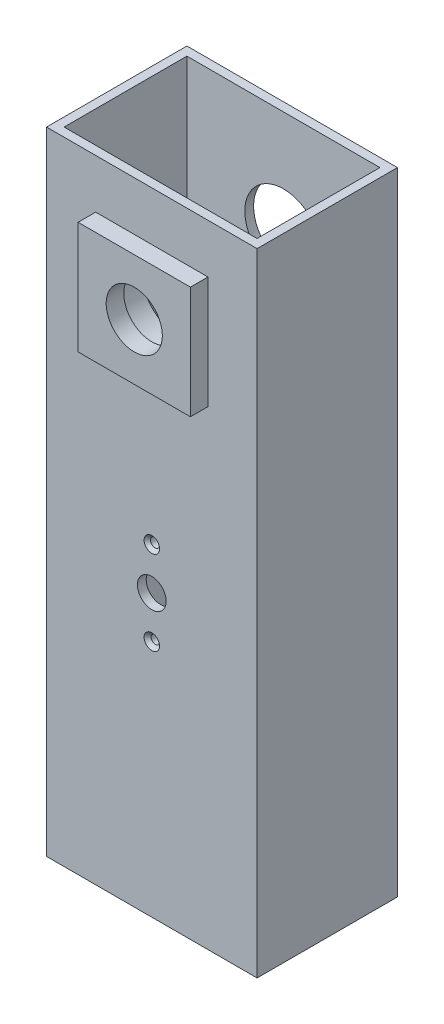
ISO-10303-21;
HEADER;
FILE_DESCRIPTION(('STEP AP214'),'2;1');
FILE_NAME('part.step','',(''),(''),'','','');
FILE_SCHEMA(('AUTOMOTIVE_DESIGN { 1 0 10303 214 1 1 1 1 }'));
ENDSEC;
DATA;
#1=APPLICATION_CONTEXT('core data for automotive mechanical design processes');
#2=APPLICATION_PROTOCOL_DEFINITION('international standard','automotive_design',2000,#1);
#3=PRODUCT_CONTEXT('',#1,'mechanical');
#4=PRODUCT('Part','Part','',(#3));
#5=PRODUCT_RELATED_PRODUCT_CATEGORY('part','',(#4));
#6=PRODUCT_DEFINITION_FORMATION('','',#4);
#7=PRODUCT_DEFINITION_CONTEXT('part definition',#1,'design');
#8=PRODUCT_DEFINITION('design','',#6,#7);
#9=PRODUCT_DEFINITION_SHAPE('','',#8);
#10=(LENGTH_UNIT() NAMED_UNIT(*) SI_UNIT(.MILLI.,.METRE.));
#11=(NAMED_UNIT(*) PLANE_ANGLE_UNIT() SI_UNIT($,.RADIAN.));
#12=(NAMED_UNIT(*) SI_UNIT($,.STERADIAN.) SOLID_ANGLE_UNIT());
#13=UNCERTAINTY_MEASURE_WITH_UNIT(LENGTH_MEASURE(1.E-05),#10,'distance_accuracy_value','');
#14=(GEOMETRIC_REPRESENTATION_CONTEXT(3) GLOBAL_UNCERTAINTY_ASSIGNED_CONTEXT((#13)) GLOBAL_UNIT_ASSIGNED_CONTEXT((#10,
#11,#12)) REPRESENTATION_CONTEXT('',''));
#15=CARTESIAN_POINT('',(0.,0.,0.));
#16=DIRECTION('',(0.,0.,1.));
#17=DIRECTION('',(1.,0.,0.));
#18=AXIS2_PLACEMENT_3D('',#15,#16,#17);
#19=CARTESIAN_POINT('',(-30.,170.,74.3766285992629));
#20=DIRECTION('',(0.,0.,-1.));
#21=DIRECTION('',(-1.,0.,0.));
#22=AXIS2_PLACEMENT_3D('',#19,#20,#21);
#23=CYLINDRICAL_SURFACE('',#22,11.);
#24=CARTESIAN_POINT('',(-30.,170.,32.));
#25=DIRECTION('',(0.,0.,-1.));
#26=DIRECTION('',(-1.,0.,0.));
#27=AXIS2_PLACEMENT_3D('',#24,#25,#26);
#28=CIRCLE('',#27,11.);
#29=CARTESIAN_POINT('',(-41.,170.,32.));
#30=VERTEX_POINT('',#29);
#31=EDGE_CURVE('E168',#30,#30,#28,.T.);
#32=ORIENTED_EDGE('',*,*,#31,.T.);
#33=EDGE_LOOP('',(#32));
#34=FACE_BOUND('',#33,.T.);
#35=CARTESIAN_POINT('',(-30.,170.,40.));
#36=DIRECTION('',(0.,0.,1.));
#37=DIRECTION('',(1.,0.,0.));
#38=AXIS2_PLACEMENT_3D('',#35,#36,#37);
#39=CIRCLE('',#38,11.);
#40=CARTESIAN_POINT('',(-19.,170.,40.));
#41=VERTEX_POINT('',#40);
#42=EDGE_CURVE('E11',#41,#41,#39,.F.);
#43=ORIENTED_EDGE('',*,*,#42,.F.);
#44=EDGE_LOOP('',(#43));
#45=FACE_BOUND('',#44,.T.);
#46=ADVANCED_FACE('F33',(#34,#45),#23,.F.);
#47=CARTESIAN_POINT('',(0.,200.,40.));
#48=DIRECTION('',(0.,0.,-1.));
#49=DIRECTION('',(-1.,0.,0.));
#50=AXIS2_PLACEMENT_3D('',#47,#48,#49);
#51=PLANE('',#50);
#52=DIRECTION('',(-1.,0.,0.));
#53=VECTOR('',#52,1.);
#54=CARTESIAN_POINT('',(0.,20.,40.));
#55=LINE('',#54,#53);
#56=CARTESIAN_POINT('',(0.,20.,40.));
#57=VERTEX_POINT('',#56);
#58=CARTESIAN_POINT('',(-60.,20.,40.));
#59=VERTEX_POINT('',#58);
#60=EDGE_CURVE('E227',#57,#59,#55,.T.);
#61=ORIENTED_EDGE('',*,*,#60,.F.);
#62=DIRECTION('',(0.,-1.,0.));
#63=VECTOR('',#62,1.);
#64=CARTESIAN_POINT('',(0.,200.,40.));
#65=LINE('',#64,#63);
#66=CARTESIAN_POINT('',(0.,200.,40.));
#67=VERTEX_POINT('',#66);
#68=EDGE_CURVE('E285',#67,#57,#65,.T.);
#69=ORIENTED_EDGE('',*,*,#68,.F.);
#70=DIRECTION('',(1.,0.,0.));
#71=VECTOR('',#70,1.);
#72=CARTESIAN_POINT('',(0.,200.,40.));
#73=LINE('',#72,#71);
#74=CARTESIAN_POINT('',(-60.,200.,40.));
#75=VERTEX_POINT('',#74);
#76=EDGE_CURVE('E283',#75,#67,#73,.T.);
#77=ORIENTED_EDGE('',*,*,#76,.F.);
#78=DIRECTION('',(0.,-1.,0.));
#79=VECTOR('',#78,1.);
#80=CARTESIAN_POINT('',(-60.,200.,40.));
#81=LINE('',#80,#79);
#82=EDGE_CURVE('E288',#75,#59,#81,.T.);
#83=ORIENTED_EDGE('',*,*,#82,.T.);
#84=EDGE_LOOP('',(#61,#69,#77,#83));
#85=FACE_BOUND('',#84,.T.);
#86=CARTESIAN_POINT('',(-30.,100.,40.));
#87=DIRECTION('',(0.,0.,1.));
#88=DIRECTION('',(1.,0.,0.));
#89=AXIS2_PLACEMENT_3D('',#86,#87,#88);
#90=CIRCLE('',#89,4.1);
#91=CARTESIAN_POINT('',(-25.9,100.,40.));
#92=VERTEX_POINT('',#91);
#93=EDGE_CURVE('E201',#92,#92,#90,.T.);
#94=ORIENTED_EDGE('',*,*,#93,.F.);
#95=EDGE_LOOP('',(#94));
#96=FACE_BOUND('',#95,.T.);
#97=CARTESIAN_POINT('',(-30.,88.,40.));
#98=DIRECTION('',(0.,0.,1.));
#99=DIRECTION('',(1.,0.,0.));
#100=AXIS2_PLACEMENT_3D('',#97,#98,#99);
#101=CIRCLE('',#100,2.2);
#102=CARTESIAN_POINT('',(-27.8,88.,40.));
#103=VERTEX_POINT('',#102);
#104=EDGE_CURVE('E194',#103,#103,#101,.T.);
#105=ORIENTED_EDGE('',*,*,#104,.F.);
#106=EDGE_LOOP('',(#105));
#107=FACE_BOUND('',#106,.T.);
#108=CARTESIAN_POINT('',(-30.,112.,40.));
#109=DIRECTION('',(0.,0.,1.));
#110=DIRECTION('',(1.,0.,0.));
#111=AXIS2_PLACEMENT_3D('',#108,#109,#110);
#112=CIRCLE('',#111,2.2);
#113=CARTESIAN_POINT('',(-27.8,112.,40.));
#114=VERTEX_POINT('',#113);
#115=EDGE_CURVE('E188',#114,#114,#112,.T.);
#116=ORIENTED_EDGE('',*,*,#115,.F.);
#117=EDGE_LOOP('',(#116));
#118=FACE_BOUND('',#117,.T.);
#119=DIRECTION('',(0.,-1.,0.));
#120=VECTOR('',#119,1.);
#121=CARTESIAN_POINT('',(-46.,154.,40.));
#122=LINE('',#121,#120);
#123=CARTESIAN_POINT('',(-46.,186.,40.));
#124=VERTEX_POINT('',#123);
#125=CARTESIAN_POINT('',(-46.,154.,40.));
#126=VERTEX_POINT('',#125);
#127=EDGE_CURVE('E167',#124,#126,#122,.T.);
#128=ORIENTED_EDGE('',*,*,#127,.F.);
#129=DIRECTION('',(-1.,0.,0.));
#130=VECTOR('',#129,1.);
#131=CARTESIAN_POINT('',(-14.,186.,40.));
#132=LINE('',#131,#130);
#133=CARTESIAN_POINT('',(-14.,186.,40.));
#134=VERTEX_POINT('',#133);
#135=EDGE_CURVE('E164',#134,#124,#132,.T.);
#136=ORIENTED_EDGE('',*,*,#135,.F.);
#137=DIRECTION('',(0.,1.,0.));
#138=VECTOR('',#137,1.);
#139=CARTESIAN_POINT('',(-14.,154.,40.));
#140=LINE('',#139,#138);
#141=CARTESIAN_POINT('',(-14.,154.,40.));
#142=VERTEX_POINT('',#141);
#143=EDGE_CURVE('E53',#142,#134,#140,.T.);
#144=ORIENTED_EDGE('',*,*,#143,.F.);
#145=DIRECTION('',(1.,0.,0.));
#146=VECTOR('',#145,1.);
#147=CARTESIAN_POINT('',(-14.,154.,40.));
#148=LINE('',#147,#146);
#149=EDGE_CURVE('E48',#126,#142,#148,.T.);
#150=ORIENTED_EDGE('',*,*,#149,.F.);
#151=EDGE_LOOP('',(#128,#136,#144,#150));
#152=FACE_BOUND('',#151,.T.);
#153=ADVANCED_FACE('F313',(#85,#96,#107,#118,#152),#51,.F.);
#154=CARTESIAN_POINT('',(-2.5,200.,37.5));
#155=DIRECTION('',(0.,0.,-1.));
#156=DIRECTION('',(-1.,0.,0.));
#157=AXIS2_PLACEMENT_3D('',#154,#155,#156);
#158=PLANE('',#157);
#159=CARTESIAN_POINT('',(-30.,88.,37.5));
#160=DIRECTION('',(0.,0.,-1.));
#161=DIRECTION('',(-1.,0.,0.));
#162=AXIS2_PLACEMENT_3D('',#159,#160,#161);
#163=CIRCLE('',#162,1.19999999999999);
#164=CARTESIAN_POINT('',(-31.2,88.,37.5));
#165=VERTEX_POINT('',#164);
#166=EDGE_CURVE('E200',#165,#165,#163,.T.);
#167=ORIENTED_EDGE('',*,*,#166,.F.);
#168=EDGE_LOOP('',(#167));
#169=FACE_BOUND('',#168,.T.);
#170=CARTESIAN_POINT('',(-30.,112.,37.5));
#171=DIRECTION('',(0.,0.,-1.));
#172=DIRECTION('',(-1.,0.,0.));
#173=AXIS2_PLACEMENT_3D('',#170,#171,#172);
#174=CIRCLE('',#173,1.28985660847614);
#175=CARTESIAN_POINT('',(-31.2898566084761,112.,37.5));
#176=VERTEX_POINT('',#175);
#177=EDGE_CURVE('E205',#176,#176,#174,.T.);
#178=ORIENTED_EDGE('',*,*,#177,.F.);
#179=EDGE_LOOP('',(#178));
#180=FACE_BOUND('',#179,.T.);
#181=CARTESIAN_POINT('',(-30.,100.,37.5));
#182=DIRECTION('',(0.,0.,-1.));
#183=DIRECTION('',(-1.,0.,0.));
#184=AXIS2_PLACEMENT_3D('',#181,#182,#183);
#185=CIRCLE('',#184,4.1);
#186=CARTESIAN_POINT('',(-34.1,100.,37.5));
#187=VERTEX_POINT('',#186);
#188=EDGE_CURVE('E204',#187,#187,#185,.T.);
#189=ORIENTED_EDGE('',*,*,#188,.F.);
#190=EDGE_LOOP('',(#189));
#191=FACE_BOUND('',#190,.T.);
#192=DIRECTION('',(1.,0.,0.));
#193=VECTOR('',#192,1.);
#194=CARTESIAN_POINT('',(-10.,190.,37.5));
#195=LINE('',#194,#193);
#196=CARTESIAN_POINT('',(-50.,190.,37.5));
#197=VERTEX_POINT('',#196);
#198=CARTESIAN_POINT('',(-10.,190.,37.5));
#199=VERTEX_POINT('',#198);
#200=EDGE_CURVE('E232',#197,#199,#195,.T.);
#201=ORIENTED_EDGE('',*,*,#200,.F.);
#202=DIRECTION('',(0.,1.,0.));
#203=VECTOR('',#202,1.);
#204=CARTESIAN_POINT('',(-50.,150.,37.5));
#205=LINE('',#204,#203);
#206=CARTESIAN_POINT('',(-50.,150.,37.5));
#207=VERTEX_POINT('',#206);
#208=EDGE_CURVE('E229',#207,#197,#205,.T.);
#209=ORIENTED_EDGE('',*,*,#208,.F.);
#210=DIRECTION('',(-1.,0.,0.));
#211=VECTOR('',#210,1.);
#212=CARTESIAN_POINT('',(-10.,150.,37.5));
#213=LINE('',#212,#211);
#214=CARTESIAN_POINT('',(-10.,150.,37.5));
#215=VERTEX_POINT('',#214);
#216=EDGE_CURVE('E237',#215,#207,#213,.T.);
#217=ORIENTED_EDGE('',*,*,#216,.F.);
#218=DIRECTION('',(0.,-1.,0.));
#219=VECTOR('',#218,1.);
#220=CARTESIAN_POINT('',(-10.,150.,37.5));
#221=LINE('',#220,#219);
#222=EDGE_CURVE('E234',#199,#215,#221,.T.);
#223=ORIENTED_EDGE('',*,*,#222,.F.);
#224=EDGE_LOOP('',(#201,#209,#217,#223));
#225=FACE_BOUND('',#224,.T.);
#226=DIRECTION('',(0.,-1.,0.));
#227=VECTOR('',#226,1.);
#228=CARTESIAN_POINT('',(-2.5,200.,37.5));
#229=LINE('',#228,#227);
#230=CARTESIAN_POINT('',(-2.5,200.,37.5));
#231=VERTEX_POINT('',#230);
#232=CARTESIAN_POINT('',(-2.5,20.,37.5));
#233=VERTEX_POINT('',#232);
#234=EDGE_CURVE('E264',#231,#233,#229,.T.);
#235=ORIENTED_EDGE('',*,*,#234,.T.);
#236=DIRECTION('',(-1.,0.,0.));
#237=VECTOR('',#236,1.);
#238=CARTESIAN_POINT('',(-2.5,20.,37.5));
#239=LINE('',#238,#237);
#240=CARTESIAN_POINT('',(-57.5,20.,37.5));
#241=VERTEX_POINT('',#240);
#242=EDGE_CURVE('E224',#233,#241,#239,.T.);
#243=ORIENTED_EDGE('',*,*,#242,.T.);
#244=DIRECTION('',(0.,-1.,0.));
#245=VECTOR('',#244,1.);
#246=CARTESIAN_POINT('',(-57.5,200.,37.5));
#247=LINE('',#246,#245);
#248=CARTESIAN_POINT('',(-57.5,200.,37.5));
#249=VERTEX_POINT('',#248);
#250=EDGE_CURVE('E267',#249,#241,#247,.T.);
#251=ORIENTED_EDGE('',*,*,#250,.F.);
#252=DIRECTION('',(1.,0.,0.));
#253=VECTOR('',#252,1.);
#254=CARTESIAN_POINT('',(-2.5,200.,37.5));
#255=LINE('',#254,#253);
#256=EDGE_CURVE('E262',#249,#231,#255,.T.);
#257=ORIENTED_EDGE('',*,*,#256,.T.);
#258=EDGE_LOOP('',(#235,#243,#251,#257));
#259=FACE_BOUND('',#258,.T.);
#260=ADVANCED_FACE('F310',(#169,#180,#191,#225,#259),#158,.T.);
#261=CARTESIAN_POINT('',(0.,200.,0.));
#262=DIRECTION('',(-1.,0.,0.));
#263=DIRECTION('',(0.,0.,1.));
#264=AXIS2_PLACEMENT_3D('',#261,#262,#263);
#265=PLANE('',#264);
#266=DIRECTION('',(0.,0.,-1.));
#267=VECTOR('',#266,1.);
#268=CARTESIAN_POINT('',(0.,20.,73.));
#269=LINE('',#268,#267);
#270=CARTESIAN_POINT('',(0.,20.,0.));
#271=VERTEX_POINT('',#270);
#272=EDGE_CURVE('E213',#57,#271,#269,.T.);
#273=ORIENTED_EDGE('',*,*,#272,.T.);
#274=DIRECTION('',(0.,-1.,0.));
#275=VECTOR('',#274,1.);
#276=CARTESIAN_POINT('',(0.,200.,0.));
#277=LINE('',#276,#275);
#278=CARTESIAN_POINT('',(0.,200.,0.));
#279=VERTEX_POINT('',#278);
#280=EDGE_CURVE('E294',#279,#271,#277,.T.);
#281=ORIENTED_EDGE('',*,*,#280,.F.);
#282=DIRECTION('',(0.,0.,-1.));
#283=VECTOR('',#282,1.);
#284=CARTESIAN_POINT('',(0.,200.,0.));
#285=LINE('',#284,#283);
#286=EDGE_CURVE('E276',#67,#279,#285,.T.);
#287=ORIENTED_EDGE('',*,*,#286,.F.);
#288=ORIENTED_EDGE('',*,*,#68,.T.);
#289=EDGE_LOOP('',(#273,#281,#287,#288));
#290=FACE_BOUND('',#289,.T.);
#291=ADVANCED_FACE('F35',(#290),#265,.F.);
#292=CARTESIAN_POINT('',(0.,200.,0.));
#293=DIRECTION('',(0.,0.,1.));
#294=DIRECTION('',(1.,0.,0.));
#295=AXIS2_PLACEMENT_3D('',#292,#293,#294);
#296=PLANE('',#295);
#297=CARTESIAN_POINT('',(-30.,100.,0.));
#298=DIRECTION('',(0.,0.,-1.));
#299=DIRECTION('',(-1.,0.,0.));
#300=AXIS2_PLACEMENT_3D('',#297,#298,#299);
#301=CIRCLE('',#300,22.);
#302=CARTESIAN_POINT('',(-52.,100.,0.));
#303=VERTEX_POINT('',#302);
#304=EDGE_CURVE('E206',#303,#303,#301,.T.);
#305=ORIENTED_EDGE('',*,*,#304,.F.);
#306=EDGE_LOOP('',(#305));
#307=FACE_BOUND('',#306,.T.);
#308=CARTESIAN_POINT('',(-30.,170.,0.));
#309=DIRECTION('',(0.,0.,-1.));
#310=DIRECTION('',(-1.,0.,0.));
#311=AXIS2_PLACEMENT_3D('',#308,#309,#310);
#312=CIRCLE('',#311,11.);
#313=CARTESIAN_POINT('',(-41.,170.,0.));
#314=VERTEX_POINT('',#313);
#315=EDGE_CURVE('E249',#314,#314,#312,.T.);
#316=ORIENTED_EDGE('',*,*,#315,.F.);
#317=EDGE_LOOP('',(#316));
#318=FACE_BOUND('',#317,.T.);
#319=DIRECTION('',(-1.,0.,0.));
#320=VECTOR('',#319,1.);
#321=CARTESIAN_POINT('',(0.,20.,0.));
#322=LINE('',#321,#320);
#323=CARTESIAN_POINT('',(-60.,20.,0.));
#324=VERTEX_POINT('',#323);
#325=EDGE_CURVE('E210',#271,#324,#322,.T.);
#326=ORIENTED_EDGE('',*,*,#325,.T.);
#327=DIRECTION('',(0.,-1.,0.));
#328=VECTOR('',#327,1.);
#329=CARTESIAN_POINT('',(-60.,200.,0.));
#330=LINE('',#329,#328);
#331=CARTESIAN_POINT('',(-60.,200.,0.));
#332=VERTEX_POINT('',#331);
#333=EDGE_CURVE('E291',#332,#324,#330,.T.);
#334=ORIENTED_EDGE('',*,*,#333,.F.);
#335=DIRECTION('',(-1.,0.,0.));
#336=VECTOR('',#335,1.);
#337=CARTESIAN_POINT('',(0.,200.,0.));
#338=LINE('',#337,#336);
#339=EDGE_CURVE('E279',#279,#332,#338,.T.);
#340=ORIENTED_EDGE('',*,*,#339,.F.);
#341=ORIENTED_EDGE('',*,*,#280,.T.);
#342=EDGE_LOOP('',(#326,#334,#340,#341));
#343=FACE_BOUND('',#342,.T.);
#344=ADVANCED_FACE('F360',(#307,#318,#343),#296,.F.);
#345=CARTESIAN_POINT('',(-60.,200.,0.));
#346=DIRECTION('',(1.,0.,0.));
#347=DIRECTION('',(0.,0.,-1.));
#348=AXIS2_PLACEMENT_3D('',#345,#346,#347);
#349=PLANE('',#348);
#350=DIRECTION('',(0.,0.,-1.));
#351=VECTOR('',#350,1.);
#352=CARTESIAN_POINT('',(-60.,20.,73.));
#353=LINE('',#352,#351);
#354=EDGE_CURVE('E214',#59,#324,#353,.T.);
#355=ORIENTED_EDGE('',*,*,#354,.F.);
#356=ORIENTED_EDGE('',*,*,#82,.F.);
#357=DIRECTION('',(0.,0.,1.));
#358=VECTOR('',#357,1.);
#359=CARTESIAN_POINT('',(-60.,200.,0.));
#360=LINE('',#359,#358);
#361=EDGE_CURVE('E281',#332,#75,#360,.T.);
#362=ORIENTED_EDGE('',*,*,#361,.F.);
#363=ORIENTED_EDGE('',*,*,#333,.T.);
#364=EDGE_LOOP('',(#355,#356,#362,#363));
#365=FACE_BOUND('',#364,.T.);
#366=ADVANCED_FACE('F351',(#365),#349,.F.);
#367=CARTESIAN_POINT('',(-2.5,200.,2.5));
#368=DIRECTION('',(-1.,0.,0.));
#369=DIRECTION('',(0.,0.,1.));
#370=AXIS2_PLACEMENT_3D('',#367,#368,#369);
#371=PLANE('',#370);
#372=DIRECTION('',(0.,-1.,0.));
#373=VECTOR('',#372,1.);
#374=CARTESIAN_POINT('',(-2.5,200.,2.5));
#375=LINE('',#374,#373);
#376=CARTESIAN_POINT('',(-2.5,200.,2.5));
#377=VERTEX_POINT('',#376);
#378=CARTESIAN_POINT('',(-2.5,20.,2.5));
#379=VERTEX_POINT('',#378);
#380=EDGE_CURVE('E273',#377,#379,#375,.T.);
#381=ORIENTED_EDGE('',*,*,#380,.T.);
#382=DIRECTION('',(0.,0.,1.));
#383=VECTOR('',#382,1.);
#384=CARTESIAN_POINT('',(-2.5,20.,2.5));
#385=LINE('',#384,#383);
#386=EDGE_CURVE('E221',#379,#233,#385,.T.);
#387=ORIENTED_EDGE('',*,*,#386,.T.);
#388=ORIENTED_EDGE('',*,*,#234,.F.);
#389=DIRECTION('',(0.,0.,-1.));
#390=VECTOR('',#389,1.);
#391=CARTESIAN_POINT('',(-2.5,200.,2.5));
#392=LINE('',#391,#390);
#393=EDGE_CURVE('E255',#231,#377,#392,.T.);
#394=ORIENTED_EDGE('',*,*,#393,.T.);
#395=EDGE_LOOP('',(#381,#387,#388,#394));
#396=FACE_BOUND('',#395,.T.);
#397=ADVANCED_FACE('F327',(#396),#371,.T.);
#398=CARTESIAN_POINT('',(-2.5,200.,2.5));
#399=DIRECTION('',(0.,0.,1.));
#400=DIRECTION('',(1.,0.,0.));
#401=AXIS2_PLACEMENT_3D('',#398,#399,#400);
#402=PLANE('',#401);
#403=CARTESIAN_POINT('',(-30.,100.,2.5));
#404=DIRECTION('',(0.,0.,1.));
#405=DIRECTION('',(1.,0.,0.));
#406=AXIS2_PLACEMENT_3D('',#403,#404,#405);
#407=CIRCLE('',#406,22.);
#408=CARTESIAN_POINT('',(-7.99999999999999,100.,2.5));
#409=VERTEX_POINT('',#408);
#410=EDGE_CURVE('E209',#409,#409,#407,.T.);
#411=ORIENTED_EDGE('',*,*,#410,.F.);
#412=EDGE_LOOP('',(#411));
#413=FACE_BOUND('',#412,.T.);
#414=CARTESIAN_POINT('',(-30.,170.,2.5));
#415=DIRECTION('',(0.,0.,1.));
#416=DIRECTION('',(1.,0.,0.));
#417=AXIS2_PLACEMENT_3D('',#414,#415,#416);
#418=CIRCLE('',#417,11.);
#419=CARTESIAN_POINT('',(-19.,170.,2.5));
#420=VERTEX_POINT('',#419);
#421=EDGE_CURVE('E252',#420,#420,#418,.T.);
#422=ORIENTED_EDGE('',*,*,#421,.F.);
#423=EDGE_LOOP('',(#422));
#424=FACE_BOUND('',#423,.T.);
#425=DIRECTION('',(0.,-1.,0.));
#426=VECTOR('',#425,1.);
#427=CARTESIAN_POINT('',(-57.5,200.,2.5));
#428=LINE('',#427,#426);
#429=CARTESIAN_POINT('',(-57.5,200.,2.5));
#430=VERTEX_POINT('',#429);
#431=CARTESIAN_POINT('',(-57.5,20.,2.5));
#432=VERTEX_POINT('',#431);
#433=EDGE_CURVE('E270',#430,#432,#428,.T.);
#434=ORIENTED_EDGE('',*,*,#433,.T.);
#435=DIRECTION('',(1.,0.,0.));
#436=VECTOR('',#435,1.);
#437=CARTESIAN_POINT('',(-2.5,20.,2.5));
#438=LINE('',#437,#436);
#439=EDGE_CURVE('E216',#432,#379,#438,.T.);
#440=ORIENTED_EDGE('',*,*,#439,.T.);
#441=ORIENTED_EDGE('',*,*,#380,.F.);
#442=DIRECTION('',(-1.,0.,0.));
#443=VECTOR('',#442,1.);
#444=CARTESIAN_POINT('',(-2.5,200.,2.5));
#445=LINE('',#444,#443);
#446=EDGE_CURVE('E257',#377,#430,#445,.T.);
#447=ORIENTED_EDGE('',*,*,#446,.T.);
#448=EDGE_LOOP('',(#434,#440,#441,#447));
#449=FACE_BOUND('',#448,.T.);
#450=ADVANCED_FACE('F335',(#413,#424,#449),#402,.T.);
#451=CARTESIAN_POINT('',(-57.5,200.,2.5));
#452=DIRECTION('',(1.,0.,0.));
#453=DIRECTION('',(0.,0.,-1.));
#454=AXIS2_PLACEMENT_3D('',#451,#452,#453);
#455=PLANE('',#454);
#456=ORIENTED_EDGE('',*,*,#250,.T.);
#457=DIRECTION('',(0.,0.,-1.));
#458=VECTOR('',#457,1.);
#459=CARTESIAN_POINT('',(-57.5,20.,2.5));
#460=LINE('',#459,#458);
#461=EDGE_CURVE('E41',#241,#432,#460,.T.);
#462=ORIENTED_EDGE('',*,*,#461,.T.);
#463=ORIENTED_EDGE('',*,*,#433,.F.);
#464=DIRECTION('',(0.,0.,1.));
#465=VECTOR('',#464,1.);
#466=CARTESIAN_POINT('',(-57.5,200.,2.5));
#467=LINE('',#466,#465);
#468=EDGE_CURVE('E259',#430,#249,#467,.T.);
#469=ORIENTED_EDGE('',*,*,#468,.T.);
#470=EDGE_LOOP('',(#456,#462,#463,#469));
#471=FACE_BOUND('',#470,.T.);
#472=ADVANCED_FACE('F337',(#471),#455,.T.);
#473=CARTESIAN_POINT('',(0.,200.,0.));
#474=DIRECTION('',(0.,-1.,0.));
#475=DIRECTION('',(0.,0.,-1.));
#476=AXIS2_PLACEMENT_3D('',#473,#474,#475);
#477=PLANE('',#476);
#478=ORIENTED_EDGE('',*,*,#286,.T.);
#479=ORIENTED_EDGE('',*,*,#339,.T.);
#480=ORIENTED_EDGE('',*,*,#361,.T.);
#481=ORIENTED_EDGE('',*,*,#76,.T.);
#482=EDGE_LOOP('',(#478,#479,#480,#481));
#483=FACE_BOUND('',#482,.T.);
#484=ORIENTED_EDGE('',*,*,#393,.F.);
#485=ORIENTED_EDGE('',*,*,#256,.F.);
#486=ORIENTED_EDGE('',*,*,#468,.F.);
#487=ORIENTED_EDGE('',*,*,#446,.F.);
#488=EDGE_LOOP('',(#484,#485,#486,#487));
#489=FACE_BOUND('',#488,.T.);
#490=ADVANCED_FACE('F331',(#483,#489),#477,.F.);
#491=ORIENTED_EDGE('',*,*,#421,.T.);
#492=EDGE_LOOP('',(#491));
#493=FACE_BOUND('',#492,.T.);
#494=ORIENTED_EDGE('',*,*,#315,.T.);
#495=EDGE_LOOP('',(#494));
#496=FACE_BOUND('',#495,.T.);
#497=ADVANCED_FACE('F372',(#493,#496),#23,.F.);
#498=CARTESIAN_POINT('',(-50.,150.,33.));
#499=DIRECTION('',(1.,0.,0.));
#500=DIRECTION('',(0.,0.,-1.));
#501=AXIS2_PLACEMENT_3D('',#498,#499,#500);
#502=PLANE('',#501);
#503=ORIENTED_EDGE('',*,*,#208,.T.);
#504=DIRECTION('',(0.,0.,1.));
#505=VECTOR('',#504,1.);
#506=CARTESIAN_POINT('',(-50.,190.,33.));
#507=LINE('',#506,#505);
#508=CARTESIAN_POINT('',(-50.,190.,32.));
#509=VERTEX_POINT('',#508);
#510=EDGE_CURVE('E247',#509,#197,#507,.T.);
#511=ORIENTED_EDGE('',*,*,#510,.F.);
#512=DIRECTION('',(0.,1.,0.));
#513=VECTOR('',#512,1.);
#514=CARTESIAN_POINT('',(-50.,150.,32.));
#515=LINE('',#514,#513);
#516=CARTESIAN_POINT('',(-50.,150.,32.));
#517=VERTEX_POINT('',#516);
#518=EDGE_CURVE('E179',#517,#509,#515,.T.);
#519=ORIENTED_EDGE('',*,*,#518,.F.);
#520=DIRECTION('',(0.,0.,1.));
#521=VECTOR('',#520,1.);
#522=CARTESIAN_POINT('',(-50.,150.,33.));
#523=LINE('',#522,#521);
#524=EDGE_CURVE('E239',#517,#207,#523,.T.);
#525=ORIENTED_EDGE('',*,*,#524,.T.);
#526=EDGE_LOOP('',(#503,#511,#519,#525));
#527=FACE_BOUND('',#526,.T.);
#528=ADVANCED_FACE('F381',(#527),#502,.F.);
#529=CARTESIAN_POINT('',(-10.,190.,33.));
#530=DIRECTION('',(0.,-1.,0.));
#531=DIRECTION('',(0.,0.,-1.));
#532=AXIS2_PLACEMENT_3D('',#529,#530,#531);
#533=PLANE('',#532);
#534=ORIENTED_EDGE('',*,*,#200,.T.);
#535=DIRECTION('',(0.,0.,1.));
#536=VECTOR('',#535,1.);
#537=CARTESIAN_POINT('',(-10.,190.,33.));
#538=LINE('',#537,#536);
#539=CARTESIAN_POINT('',(-10.,190.,32.));
#540=VERTEX_POINT('',#539);
#541=EDGE_CURVE('E244',#540,#199,#538,.T.);
#542=ORIENTED_EDGE('',*,*,#541,.F.);
#543=DIRECTION('',(1.,0.,0.));
#544=VECTOR('',#543,1.);
#545=CARTESIAN_POINT('',(-50.,190.,32.));
#546=LINE('',#545,#544);
#547=EDGE_CURVE('E182',#509,#540,#546,.T.);
#548=ORIENTED_EDGE('',*,*,#547,.F.);
#549=ORIENTED_EDGE('',*,*,#510,.T.);
#550=EDGE_LOOP('',(#534,#542,#548,#549));
#551=FACE_BOUND('',#550,.T.);
#552=ADVANCED_FACE('F387',(#551),#533,.F.);
#553=CARTESIAN_POINT('',(-10.,150.,33.));
#554=DIRECTION('',(-1.,0.,0.));
#555=DIRECTION('',(0.,0.,1.));
#556=AXIS2_PLACEMENT_3D('',#553,#554,#555);
#557=PLANE('',#556);
#558=ORIENTED_EDGE('',*,*,#222,.T.);
#559=DIRECTION('',(0.,0.,1.));
#560=VECTOR('',#559,1.);
#561=CARTESIAN_POINT('',(-10.,150.,33.));
#562=LINE('',#561,#560);
#563=CARTESIAN_POINT('',(-10.,150.,32.));
#564=VERTEX_POINT('',#563);
#565=EDGE_CURVE('E242',#564,#215,#562,.T.);
#566=ORIENTED_EDGE('',*,*,#565,.F.);
#567=DIRECTION('',(0.,-1.,0.));
#568=VECTOR('',#567,1.);
#569=CARTESIAN_POINT('',(-10.,190.,32.));
#570=LINE('',#569,#568);
#571=EDGE_CURVE('E185',#540,#564,#570,.T.);
#572=ORIENTED_EDGE('',*,*,#571,.F.);
#573=ORIENTED_EDGE('',*,*,#541,.T.);
#574=EDGE_LOOP('',(#558,#566,#572,#573));
#575=FACE_BOUND('',#574,.T.);
#576=ADVANCED_FACE('F510',(#575),#557,.F.);
#577=CARTESIAN_POINT('',(-10.,150.,33.));
#578=DIRECTION('',(0.,1.,0.));
#579=DIRECTION('',(0.,0.,1.));
#580=AXIS2_PLACEMENT_3D('',#577,#578,#579);
#581=PLANE('',#580);
#582=ORIENTED_EDGE('',*,*,#216,.T.);
#583=ORIENTED_EDGE('',*,*,#524,.F.);
#584=DIRECTION('',(-1.,0.,0.));
#585=VECTOR('',#584,1.);
#586=CARTESIAN_POINT('',(-10.,150.,32.));
#587=LINE('',#586,#585);
#588=EDGE_CURVE('E171',#564,#517,#587,.T.);
#589=ORIENTED_EDGE('',*,*,#588,.F.);
#590=ORIENTED_EDGE('',*,*,#565,.T.);
#591=EDGE_LOOP('',(#582,#583,#589,#590));
#592=FACE_BOUND('',#591,.T.);
#593=ADVANCED_FACE('F343',(#592),#581,.F.);
#594=CARTESIAN_POINT('',(0.,20.,73.));
#595=DIRECTION('',(0.,-1.,0.));
#596=DIRECTION('',(0.,0.,-1.));
#597=AXIS2_PLACEMENT_3D('',#594,#595,#596);
#598=PLANE('',#597);
#599=ORIENTED_EDGE('',*,*,#386,.F.);
#600=ORIENTED_EDGE('',*,*,#439,.F.);
#601=ORIENTED_EDGE('',*,*,#461,.F.);
#602=ORIENTED_EDGE('',*,*,#242,.F.);
#603=EDGE_LOOP('',(#599,#600,#601,#602));
#604=FACE_BOUND('',#603,.T.);
#605=ORIENTED_EDGE('',*,*,#60,.T.);
#606=ORIENTED_EDGE('',*,*,#354,.T.);
#607=ORIENTED_EDGE('',*,*,#325,.F.);
#608=ORIENTED_EDGE('',*,*,#272,.F.);
#609=EDGE_LOOP('',(#605,#606,#607,#608));
#610=FACE_BOUND('',#609,.T.);
#611=ADVANCED_FACE('F339',(#604,#610),#598,.T.);
#612=CARTESIAN_POINT('',(-30.,100.,6.));
#613=DIRECTION('',(0.,0.,-1.));
#614=DIRECTION('',(-1.,0.,0.));
#615=AXIS2_PLACEMENT_3D('',#612,#613,#614);
#616=CYLINDRICAL_SURFACE('',#615,22.);
#617=ORIENTED_EDGE('',*,*,#410,.T.);
#618=EDGE_LOOP('',(#617));
#619=FACE_BOUND('',#618,.T.);
#620=ORIENTED_EDGE('',*,*,#304,.T.);
#621=EDGE_LOOP('',(#620));
#622=FACE_BOUND('',#621,.T.);
#623=ADVANCED_FACE('F342',(#619,#622),#616,.F.);
#624=CARTESIAN_POINT('',(-30.,100.,34.));
#625=DIRECTION('',(0.,0.,1.));
#626=DIRECTION('',(1.,0.,0.));
#627=AXIS2_PLACEMENT_3D('',#624,#625,#626);
#628=CYLINDRICAL_SURFACE('',#627,4.1);
#629=ORIENTED_EDGE('',*,*,#188,.T.);
#630=EDGE_LOOP('',(#629));
#631=FACE_BOUND('',#630,.T.);
#632=ORIENTED_EDGE('',*,*,#93,.T.);
#633=EDGE_LOOP('',(#632));
#634=FACE_BOUND('',#633,.T.);
#635=ADVANCED_FACE('F489',(#631,#634),#628,.F.);
#636=CARTESIAN_POINT('',(-30.,112.,34.));
#637=DIRECTION('',(0.,0.,1.));
#638=DIRECTION('',(1.,0.,0.));
#639=AXIS2_PLACEMENT_3D('',#636,#637,#638);
#640=CYLINDRICAL_SURFACE('',#639,1.28985660847614);
#641=CARTESIAN_POINT('',(-30.,112.,39.0898566084762));
#642=DIRECTION('',(0.,0.,1.));
#643=DIRECTION('',(1.,0.,0.));
#644=AXIS2_PLACEMENT_3D('',#641,#642,#643);
#645=CIRCLE('',#644,1.28985660847614);
#646=CARTESIAN_POINT('',(-28.7101433915238,112.,39.0898566084762));
#647=VERTEX_POINT('',#646);
#648=EDGE_CURVE('E191',#647,#647,#645,.T.);
#649=ORIENTED_EDGE('',*,*,#648,.T.);
#650=EDGE_LOOP('',(#649));
#651=FACE_BOUND('',#650,.T.);
#652=ORIENTED_EDGE('',*,*,#177,.T.);
#653=EDGE_LOOP('',(#652));
#654=FACE_BOUND('',#653,.T.);
#655=ADVANCED_FACE('F481',(#651,#654),#640,.F.);
#656=CARTESIAN_POINT('',(-30.,88.,40.));
#657=DIRECTION('',(0.,0.,1.));
#658=DIRECTION('',(1.,0.,0.));
#659=AXIS2_PLACEMENT_3D('',#656,#657,#658);
#660=CYLINDRICAL_SURFACE('',#659,1.19999999999999);
#661=ORIENTED_EDGE('',*,*,#166,.T.);
#662=EDGE_LOOP('',(#661));
#663=FACE_BOUND('',#662,.T.);
#664=CARTESIAN_POINT('',(-30.,88.,39.));
#665=DIRECTION('',(0.,0.,1.));
#666=DIRECTION('',(1.,0.,0.));
#667=AXIS2_PLACEMENT_3D('',#664,#665,#666);
#668=CIRCLE('',#667,1.19999999999999);
#669=CARTESIAN_POINT('',(-28.8,88.,39.));
#670=VERTEX_POINT('',#669);
#671=EDGE_CURVE('E197',#670,#670,#668,.T.);
#672=ORIENTED_EDGE('',*,*,#671,.T.);
#673=EDGE_LOOP('',(#672));
#674=FACE_BOUND('',#673,.T.);
#675=ADVANCED_FACE('F307',(#663,#674),#660,.F.);
#676=CARTESIAN_POINT('',(-30.,88.,40.));
#677=DIRECTION('',(0.,0.,1.));
#678=DIRECTION('',(1.,0.,0.));
#679=AXIS2_PLACEMENT_3D('',#676,#677,#678);
#680=CONICAL_SURFACE('',#679,2.2,0.785398163397453);
#681=ORIENTED_EDGE('',*,*,#671,.F.);
#682=EDGE_LOOP('',(#681));
#683=FACE_BOUND('',#682,.T.);
#684=ORIENTED_EDGE('',*,*,#104,.T.);
#685=EDGE_LOOP('',(#684));
#686=FACE_BOUND('',#685,.T.);
#687=ADVANCED_FACE('F464',(#683,#686),#680,.F.);
#688=CARTESIAN_POINT('',(-30.,112.,40.));
#689=DIRECTION('',(0.,0.,1.));
#690=DIRECTION('',(1.,0.,0.));
#691=AXIS2_PLACEMENT_3D('',#688,#689,#690);
#692=CONICAL_SURFACE('',#691,2.2,0.785398163397453);
#693=ORIENTED_EDGE('',*,*,#115,.T.);
#694=EDGE_LOOP('',(#693));
#695=FACE_BOUND('',#694,.T.);
#696=ORIENTED_EDGE('',*,*,#648,.F.);
#697=EDGE_LOOP('',(#696));
#698=FACE_BOUND('',#697,.T.);
#699=ADVANCED_FACE('F457',(#695,#698),#692,.F.);
#700=CARTESIAN_POINT('',(0.,0.,32.));
#701=DIRECTION('',(0.,0.,-1.));
#702=DIRECTION('',(-1.,0.,0.));
#703=AXIS2_PLACEMENT_3D('',#700,#701,#702);
#704=PLANE('',#703);
#705=ORIENTED_EDGE('',*,*,#588,.T.);
#706=ORIENTED_EDGE('',*,*,#518,.T.);
#707=ORIENTED_EDGE('',*,*,#547,.T.);
#708=ORIENTED_EDGE('',*,*,#571,.T.);
#709=EDGE_LOOP('',(#705,#706,#707,#708));
#710=FACE_BOUND('',#709,.T.);
#711=ORIENTED_EDGE('',*,*,#31,.F.);
#712=EDGE_LOOP('',(#711));
#713=FACE_BOUND('',#712,.T.);
#714=ADVANCED_FACE('F463',(#710,#713),#704,.T.);
#715=CARTESIAN_POINT('',(0.,0.,45.));
#716=DIRECTION('',(0.,0.,1.));
#717=DIRECTION('',(1.,0.,0.));
#718=AXIS2_PLACEMENT_3D('',#715,#716,#717);
#719=PLANE('',#718);
#720=DIRECTION('',(0.,-1.,0.));
#721=VECTOR('',#720,1.);
#722=CARTESIAN_POINT('',(-46.,154.,45.));
#723=LINE('',#722,#721);
#724=CARTESIAN_POINT('',(-46.,186.,45.));
#725=VERTEX_POINT('',#724);
#726=CARTESIAN_POINT('',(-46.,154.,45.));
#727=VERTEX_POINT('',#726);
#728=EDGE_CURVE('E154',#725,#727,#723,.T.);
#729=ORIENTED_EDGE('',*,*,#728,.T.);
#730=DIRECTION('',(1.,0.,0.));
#731=VECTOR('',#730,1.);
#732=CARTESIAN_POINT('',(-14.,154.,45.));
#733=LINE('',#732,#731);
#734=CARTESIAN_POINT('',(-14.,154.,45.));
#735=VERTEX_POINT('',#734);
#736=EDGE_CURVE('E143',#727,#735,#733,.T.);
#737=ORIENTED_EDGE('',*,*,#736,.T.);
#738=DIRECTION('',(0.,1.,0.));
#739=VECTOR('',#738,1.);
#740=CARTESIAN_POINT('',(-14.,154.,45.));
#741=LINE('',#740,#739);
#742=CARTESIAN_POINT('',(-14.,186.,45.));
#743=VERTEX_POINT('',#742);
#744=EDGE_CURVE('E153',#735,#743,#741,.T.);
#745=ORIENTED_EDGE('',*,*,#744,.T.);
#746=DIRECTION('',(-1.,0.,0.));
#747=VECTOR('',#746,1.);
#748=CARTESIAN_POINT('',(-14.,186.,45.));
#749=LINE('',#748,#747);
#750=EDGE_CURVE('E160',#743,#725,#749,.T.);
#751=ORIENTED_EDGE('',*,*,#750,.T.);
#752=EDGE_LOOP('',(#729,#737,#745,#751));
#753=FACE_BOUND('',#752,.T.);
#754=CARTESIAN_POINT('',(-30.,170.,45.));
#755=DIRECTION('',(0.,0.,1.));
#756=DIRECTION('',(1.,0.,0.));
#757=AXIS2_PLACEMENT_3D('',#754,#755,#756);
#758=CIRCLE('',#757,8.);
#759=CARTESIAN_POINT('',(-22.,170.,45.));
#760=VERTEX_POINT('',#759);
#761=EDGE_CURVE('E561',#760,#760,#758,.T.);
#762=ORIENTED_EDGE('',*,*,#761,.F.);
#763=EDGE_LOOP('',(#762));
#764=FACE_BOUND('',#763,.T.);
#765=ADVANCED_FACE('F157',(#753,#764),#719,.T.);
#766=CARTESIAN_POINT('',(-46.,154.,45.));
#767=DIRECTION('',(1.,0.,0.));
#768=DIRECTION('',(0.,0.,-1.));
#769=AXIS2_PLACEMENT_3D('',#766,#767,#768);
#770=PLANE('',#769);
#771=ORIENTED_EDGE('',*,*,#127,.T.);
#772=DIRECTION('',(0.,0.,-1.));
#773=VECTOR('',#772,1.);
#774=CARTESIAN_POINT('',(-46.,154.,45.));
#775=LINE('',#774,#773);
#776=EDGE_CURVE('E147',#727,#126,#775,.T.);
#777=ORIENTED_EDGE('',*,*,#776,.F.);
#778=ORIENTED_EDGE('',*,*,#728,.F.);
#779=DIRECTION('',(0.,0.,-1.));
#780=VECTOR('',#779,1.);
#781=CARTESIAN_POINT('',(-46.,186.,45.));
#782=LINE('',#781,#780);
#783=EDGE_CURVE('E567',#725,#124,#782,.T.);
#784=ORIENTED_EDGE('',*,*,#783,.T.);
#785=EDGE_LOOP('',(#771,#777,#778,#784));
#786=FACE_BOUND('',#785,.T.);
#787=ADVANCED_FACE('F166',(#786),#770,.F.);
#788=CARTESIAN_POINT('',(-14.,154.,45.));
#789=DIRECTION('',(0.,1.,0.));
#790=DIRECTION('',(0.,0.,1.));
#791=AXIS2_PLACEMENT_3D('',#788,#789,#790);
#792=PLANE('',#791);
#793=ORIENTED_EDGE('',*,*,#149,.T.);
#794=DIRECTION('',(0.,0.,-1.));
#795=VECTOR('',#794,1.);
#796=CARTESIAN_POINT('',(-14.,154.,45.));
#797=LINE('',#796,#795);
#798=EDGE_CURVE('E150',#735,#142,#797,.T.);
#799=ORIENTED_EDGE('',*,*,#798,.F.);
#800=ORIENTED_EDGE('',*,*,#736,.F.);
#801=ORIENTED_EDGE('',*,*,#776,.T.);
#802=EDGE_LOOP('',(#793,#799,#800,#801));
#803=FACE_BOUND('',#802,.T.);
#804=ADVANCED_FACE('F145',(#803),#792,.F.);
#805=CARTESIAN_POINT('',(-14.,154.,45.));
#806=DIRECTION('',(-1.,0.,0.));
#807=DIRECTION('',(0.,0.,1.));
#808=AXIS2_PLACEMENT_3D('',#805,#806,#807);
#809=PLANE('',#808);
#810=ORIENTED_EDGE('',*,*,#143,.T.);
#811=DIRECTION('',(0.,0.,-1.));
#812=VECTOR('',#811,1.);
#813=CARTESIAN_POINT('',(-14.,186.,45.));
#814=LINE('',#813,#812);
#815=EDGE_CURVE('E173',#743,#134,#814,.T.);
#816=ORIENTED_EDGE('',*,*,#815,.F.);
#817=ORIENTED_EDGE('',*,*,#744,.F.);
#818=ORIENTED_EDGE('',*,*,#798,.T.);
#819=EDGE_LOOP('',(#810,#816,#817,#818));
#820=FACE_BOUND('',#819,.T.);
#821=ADVANCED_FACE('F538',(#820),#809,.F.);
#822=CARTESIAN_POINT('',(-14.,186.,45.));
#823=DIRECTION('',(0.,-1.,0.));
#824=DIRECTION('',(0.,0.,-1.));
#825=AXIS2_PLACEMENT_3D('',#822,#823,#824);
#826=PLANE('',#825);
#827=ORIENTED_EDGE('',*,*,#135,.T.);
#828=ORIENTED_EDGE('',*,*,#783,.F.);
#829=ORIENTED_EDGE('',*,*,#750,.F.);
#830=ORIENTED_EDGE('',*,*,#815,.T.);
#831=EDGE_LOOP('',(#827,#828,#829,#830));
#832=FACE_BOUND('',#831,.T.);
#833=ADVANCED_FACE('F541',(#832),#826,.F.);
#834=CARTESIAN_POINT('',(-30.,170.,40.));
#835=DIRECTION('',(0.,0.,1.));
#836=DIRECTION('',(1.,0.,0.));
#837=AXIS2_PLACEMENT_3D('',#834,#835,#836);
#838=PLANE('',#837);
#839=CARTESIAN_POINT('',(-30.,170.,40.));
#840=DIRECTION('',(0.,0.,1.));
#841=DIRECTION('',(1.,0.,0.));
#842=AXIS2_PLACEMENT_3D('',#839,#840,#841);
#843=CIRCLE('',#842,8.);
#844=CARTESIAN_POINT('',(-22.,170.,40.));
#845=VERTEX_POINT('',#844);
#846=EDGE_CURVE('E558',#845,#845,#843,.T.);
#847=ORIENTED_EDGE('',*,*,#846,.T.);
#848=EDGE_LOOP('',(#847));
#849=FACE_BOUND('',#848,.T.);
#850=ORIENTED_EDGE('',*,*,#42,.T.);
#851=EDGE_LOOP('',(#850));
#852=FACE_BOUND('',#851,.T.);
#853=ADVANCED_FACE('F544',(#849,#852),#838,.F.);
#854=CARTESIAN_POINT('',(-30.,170.,40.));
#855=DIRECTION('',(0.,0.,1.));
#856=DIRECTION('',(1.,0.,0.));
#857=AXIS2_PLACEMENT_3D('',#854,#855,#856);
#858=CYLINDRICAL_SURFACE('',#857,8.);
#859=ORIENTED_EDGE('',*,*,#846,.F.);
#860=EDGE_LOOP('',(#859));
#861=FACE_BOUND('',#860,.T.);
#862=ORIENTED_EDGE('',*,*,#761,.T.);
#863=EDGE_LOOP('',(#862));
#864=FACE_BOUND('',#863,.T.);
#865=ADVANCED_FACE('F549',(#861,#864),#858,.F.);
#866=CLOSED_SHELL('',(#46,#153,#260,#291,#344,#366,#397,#450,#472,#490,#497,#528,#552,#576,#593,
#611,#623,#635,#655,#675,#687,#699,#714,#765,#787,#804,#821,#833,#853,#865));
#867=MANIFOLD_SOLID_BREP('B2',#866);
#868=ADVANCED_BREP_SHAPE_REPRESENTATION('',(#18,#867),#14);
#869=SHAPE_DEFINITION_REPRESENTATION(#9,#868);
ENDSEC;
END-ISO-10303-21;
